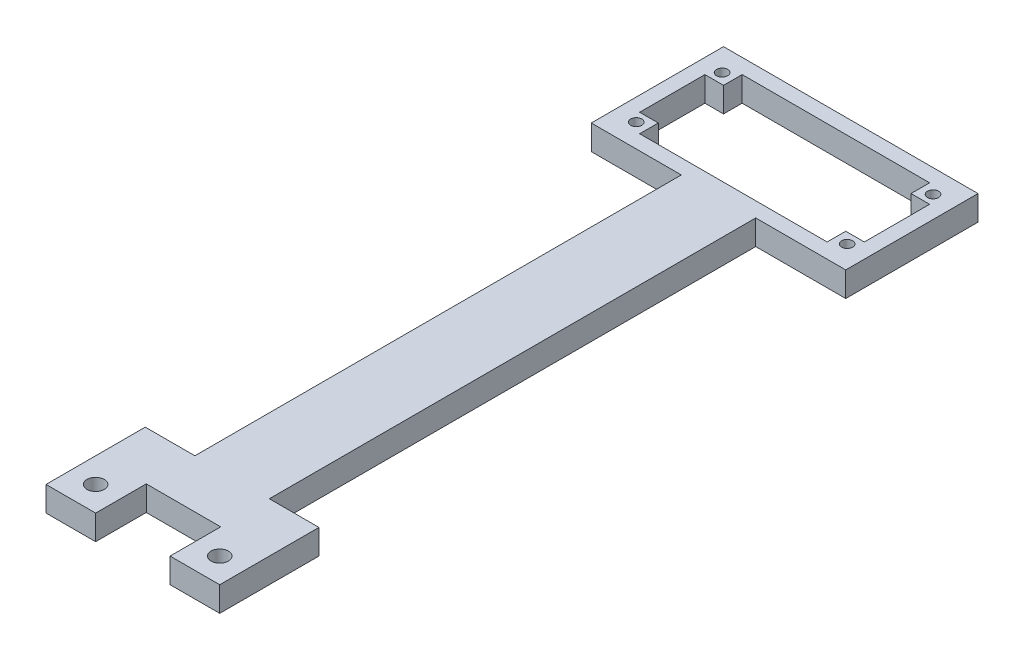
ISO-10303-21;
HEADER;
FILE_DESCRIPTION(('STEP AP214'),'2;1');
FILE_NAME('part.step','',(''),(''),'','','');
FILE_SCHEMA(('AUTOMOTIVE_DESIGN { 1 0 10303 214 1 1 1 1 }'));
ENDSEC;
DATA;
#1=APPLICATION_CONTEXT('core data for automotive mechanical design processes');
#2=APPLICATION_PROTOCOL_DEFINITION('international standard','automotive_design',2000,#1);
#3=PRODUCT_CONTEXT('',#1,'mechanical');
#4=PRODUCT('Part','Part','',(#3));
#5=PRODUCT_RELATED_PRODUCT_CATEGORY('part','',(#4));
#6=PRODUCT_DEFINITION_FORMATION('','',#4);
#7=PRODUCT_DEFINITION_CONTEXT('part definition',#1,'design');
#8=PRODUCT_DEFINITION('design','',#6,#7);
#9=PRODUCT_DEFINITION_SHAPE('','',#8);
#10=(LENGTH_UNIT() NAMED_UNIT(*) SI_UNIT(.MILLI.,.METRE.));
#11=(NAMED_UNIT(*) PLANE_ANGLE_UNIT() SI_UNIT($,.RADIAN.));
#12=(NAMED_UNIT(*) SI_UNIT($,.STERADIAN.) SOLID_ANGLE_UNIT());
#13=UNCERTAINTY_MEASURE_WITH_UNIT(LENGTH_MEASURE(1.E-05),#10,'distance_accuracy_value','');
#14=(GEOMETRIC_REPRESENTATION_CONTEXT(3) GLOBAL_UNCERTAINTY_ASSIGNED_CONTEXT((#13)) GLOBAL_UNIT_ASSIGNED_CONTEXT((#10,
#11,#12)) REPRESENTATION_CONTEXT('',''));
#15=CARTESIAN_POINT('',(0.,0.,0.));
#16=DIRECTION('',(0.,0.,1.));
#17=DIRECTION('',(1.,0.,0.));
#18=AXIS2_PLACEMENT_3D('',#15,#16,#17);
#19=CARTESIAN_POINT('',(-3.,5.,3.));
#20=DIRECTION('',(0.,0.,-1.));
#21=DIRECTION('',(-1.,0.,0.));
#22=AXIS2_PLACEMENT_3D('',#19,#20,#21);
#23=PLANE('',#22);
#24=DIRECTION('',(0.,1.,0.));
#25=VECTOR('',#24,1.);
#26=CARTESIAN_POINT('',(30.135,-109.036691072317,3.));
#27=LINE('',#26,#25);
#28=CARTESIAN_POINT('',(30.135,0.,3.));
#29=VERTEX_POINT('',#28);
#30=CARTESIAN_POINT('',(30.135,5.,3.));
#31=VERTEX_POINT('',#30);
#32=EDGE_CURVE('E364',#29,#31,#27,.T.);
#33=ORIENTED_EDGE('',*,*,#32,.F.);
#34=DIRECTION('',(1.,0.,0.));
#35=VECTOR('',#34,1.);
#36=CARTESIAN_POINT('',(-3.,0.,3.));
#37=LINE('',#36,#35);
#38=CARTESIAN_POINT('',(48.27,0.,3.));
#39=VERTEX_POINT('',#38);
#40=EDGE_CURVE('E516',#29,#39,#37,.T.);
#41=ORIENTED_EDGE('',*,*,#40,.T.);
#42=DIRECTION('',(0.,-1.,0.));
#43=VECTOR('',#42,1.);
#44=CARTESIAN_POINT('',(48.27,5.,3.));
#45=LINE('',#44,#43);
#46=CARTESIAN_POINT('',(48.27,5.,3.));
#47=VERTEX_POINT('',#46);
#48=EDGE_CURVE('E11',#47,#39,#45,.T.);
#49=ORIENTED_EDGE('',*,*,#48,.F.);
#50=DIRECTION('',(1.,0.,0.));
#51=VECTOR('',#50,1.);
#52=CARTESIAN_POINT('',(-3.,5.,3.));
#53=LINE('',#52,#51);
#54=EDGE_CURVE('E534',#31,#47,#53,.T.);
#55=ORIENTED_EDGE('',*,*,#54,.F.);
#56=EDGE_LOOP('',(#33,#41,#49,#55));
#57=FACE_BOUND('',#56,.T.);
#58=ADVANCED_FACE('F39',(#57),#23,.F.);
#59=CARTESIAN_POINT('',(-3.,0.,3.));
#60=VERTEX_POINT('',#59);
#61=CARTESIAN_POINT('',(15.135,0.,3.));
#62=VERTEX_POINT('',#61);
#63=EDGE_CURVE('E544',#60,#62,#37,.T.);
#64=ORIENTED_EDGE('',*,*,#63,.T.);
#65=DIRECTION('',(0.,1.,0.));
#66=VECTOR('',#65,1.);
#67=CARTESIAN_POINT('',(15.135,-109.036691072317,3.));
#68=LINE('',#67,#66);
#69=CARTESIAN_POINT('',(15.135,5.,3.));
#70=VERTEX_POINT('',#69);
#71=EDGE_CURVE('E63',#62,#70,#68,.T.);
#72=ORIENTED_EDGE('',*,*,#71,.T.);
#73=CARTESIAN_POINT('',(-3.,5.,3.));
#74=VERTEX_POINT('',#73);
#75=EDGE_CURVE('E530',#74,#70,#53,.T.);
#76=ORIENTED_EDGE('',*,*,#75,.F.);
#77=DIRECTION('',(0.,-1.,0.));
#78=VECTOR('',#77,1.);
#79=CARTESIAN_POINT('',(-3.,5.,3.));
#80=LINE('',#79,#78);
#81=EDGE_CURVE('E543',#74,#60,#80,.T.);
#82=ORIENTED_EDGE('',*,*,#81,.T.);
#83=EDGE_LOOP('',(#64,#72,#76,#82));
#84=FACE_BOUND('',#83,.T.);
#85=ADVANCED_FACE('F41',(#84),#23,.F.);
#86=CARTESIAN_POINT('',(48.27,5.,3.));
#87=DIRECTION('',(-1.,0.,0.));
#88=DIRECTION('',(0.,0.,1.));
#89=AXIS2_PLACEMENT_3D('',#86,#87,#88);
#90=PLANE('',#89);
#91=DIRECTION('',(0.,0.,-1.));
#92=VECTOR('',#91,1.);
#93=CARTESIAN_POINT('',(48.27,0.,3.));
#94=LINE('',#93,#92);
#95=CARTESIAN_POINT('',(48.27,0.,-23.65));
#96=VERTEX_POINT('',#95);
#97=EDGE_CURVE('E547',#39,#96,#94,.T.);
#98=ORIENTED_EDGE('',*,*,#97,.T.);
#99=DIRECTION('',(0.,-1.,0.));
#100=VECTOR('',#99,1.);
#101=CARTESIAN_POINT('',(48.27,5.,-23.65));
#102=LINE('',#101,#100);
#103=CARTESIAN_POINT('',(48.27,5.,-23.65));
#104=VERTEX_POINT('',#103);
#105=EDGE_CURVE('E48',#104,#96,#102,.T.);
#106=ORIENTED_EDGE('',*,*,#105,.F.);
#107=DIRECTION('',(0.,0.,-1.));
#108=VECTOR('',#107,1.);
#109=CARTESIAN_POINT('',(48.27,5.,3.));
#110=LINE('',#109,#108);
#111=EDGE_CURVE('E533',#47,#104,#110,.T.);
#112=ORIENTED_EDGE('',*,*,#111,.F.);
#113=ORIENTED_EDGE('',*,*,#48,.T.);
#114=EDGE_LOOP('',(#98,#106,#112,#113));
#115=FACE_BOUND('',#114,.T.);
#116=ADVANCED_FACE('F624',(#115),#90,.F.);
#117=CARTESIAN_POINT('',(48.27,5.,-23.65));
#118=DIRECTION('',(0.,0.,1.));
#119=DIRECTION('',(1.,0.,0.));
#120=AXIS2_PLACEMENT_3D('',#117,#118,#119);
#121=PLANE('',#120);
#122=DIRECTION('',(-1.,0.,0.));
#123=VECTOR('',#122,1.);
#124=CARTESIAN_POINT('',(48.27,0.,-23.65));
#125=LINE('',#124,#123);
#126=CARTESIAN_POINT('',(-3.,0.,-23.65));
#127=VERTEX_POINT('',#126);
#128=EDGE_CURVE('E550',#96,#127,#125,.T.);
#129=ORIENTED_EDGE('',*,*,#128,.T.);
#130=DIRECTION('',(0.,-1.,0.));
#131=VECTOR('',#130,1.);
#132=CARTESIAN_POINT('',(-3.,5.,-23.65));
#133=LINE('',#132,#131);
#134=CARTESIAN_POINT('',(-3.,5.,-23.65));
#135=VERTEX_POINT('',#134);
#136=EDGE_CURVE('E559',#135,#127,#133,.T.);
#137=ORIENTED_EDGE('',*,*,#136,.F.);
#138=DIRECTION('',(-1.,0.,0.));
#139=VECTOR('',#138,1.);
#140=CARTESIAN_POINT('',(48.27,5.,-23.65));
#141=LINE('',#140,#139);
#142=EDGE_CURVE('E537',#104,#135,#141,.T.);
#143=ORIENTED_EDGE('',*,*,#142,.F.);
#144=ORIENTED_EDGE('',*,*,#105,.T.);
#145=EDGE_LOOP('',(#129,#137,#143,#144));
#146=FACE_BOUND('',#145,.T.);
#147=ADVANCED_FACE('F568',(#146),#121,.F.);
#148=CARTESIAN_POINT('',(-3.,5.,-23.65));
#149=DIRECTION('',(1.,0.,0.));
#150=DIRECTION('',(0.,0.,-1.));
#151=AXIS2_PLACEMENT_3D('',#148,#149,#150);
#152=PLANE('',#151);
#153=DIRECTION('',(0.,0.,1.));
#154=VECTOR('',#153,1.);
#155=CARTESIAN_POINT('',(-3.,0.,-23.65));
#156=LINE('',#155,#154);
#157=EDGE_CURVE('E553',#127,#60,#156,.T.);
#158=ORIENTED_EDGE('',*,*,#157,.T.);
#159=ORIENTED_EDGE('',*,*,#81,.F.);
#160=DIRECTION('',(0.,0.,1.));
#161=VECTOR('',#160,1.);
#162=CARTESIAN_POINT('',(-3.,5.,-23.65));
#163=LINE('',#162,#161);
#164=EDGE_CURVE('E540',#135,#74,#163,.T.);
#165=ORIENTED_EDGE('',*,*,#164,.F.);
#166=ORIENTED_EDGE('',*,*,#136,.T.);
#167=EDGE_LOOP('',(#158,#159,#165,#166));
#168=FACE_BOUND('',#167,.T.);
#169=ADVANCED_FACE('F578',(#168),#152,.F.);
#170=CARTESIAN_POINT('',(0.,5.,0.));
#171=DIRECTION('',(0.,1.,0.));
#172=DIRECTION('',(0.,0.,1.));
#173=AXIS2_PLACEMENT_3D('',#170,#171,#172);
#174=PLANE('',#173);
#175=DIRECTION('',(0.,0.,-1.));
#176=VECTOR('',#175,1.);
#177=CARTESIAN_POINT('',(15.135,5.,101.));
#178=LINE('',#177,#176);
#179=CARTESIAN_POINT('',(15.135,5.,121.));
#180=VERTEX_POINT('',#179);
#181=CARTESIAN_POINT('',(15.135,5.,110.8));
#182=VERTEX_POINT('',#181);
#183=EDGE_CURVE('E267',#180,#182,#178,.T.);
#184=ORIENTED_EDGE('',*,*,#183,.T.);
#185=DIRECTION('',(-1.,0.,0.));
#186=VECTOR('',#185,1.);
#187=CARTESIAN_POINT('',(15.135,5.,110.8));
#188=LINE('',#187,#186);
#189=CARTESIAN_POINT('',(30.135,5.,110.8));
#190=VERTEX_POINT('',#189);
#191=EDGE_CURVE('E255',#190,#182,#188,.T.);
#192=ORIENTED_EDGE('',*,*,#191,.F.);
#193=DIRECTION('',(0.,0.,1.));
#194=VECTOR('',#193,1.);
#195=CARTESIAN_POINT('',(30.135,5.,101.));
#196=LINE('',#195,#194);
#197=CARTESIAN_POINT('',(30.135,5.,121.));
#198=VERTEX_POINT('',#197);
#199=EDGE_CURVE('E244',#190,#198,#196,.T.);
#200=ORIENTED_EDGE('',*,*,#199,.T.);
#201=DIRECTION('',(1.,0.,0.));
#202=VECTOR('',#201,1.);
#203=CARTESIAN_POINT('',(30.135,5.,121.));
#204=LINE('',#203,#202);
#205=CARTESIAN_POINT('',(40.135,5.,121.));
#206=VERTEX_POINT('',#205);
#207=EDGE_CURVE('E324',#198,#206,#204,.T.);
#208=ORIENTED_EDGE('',*,*,#207,.T.);
#209=DIRECTION('',(0.,0.,-1.));
#210=VECTOR('',#209,1.);
#211=CARTESIAN_POINT('',(40.135,5.,101.));
#212=LINE('',#211,#210);
#213=CARTESIAN_POINT('',(40.135,5.,101.));
#214=VERTEX_POINT('',#213);
#215=EDGE_CURVE('E328',#206,#214,#212,.T.);
#216=ORIENTED_EDGE('',*,*,#215,.T.);
#217=DIRECTION('',(-1.,0.,0.));
#218=VECTOR('',#217,1.);
#219=CARTESIAN_POINT('',(30.135,5.,101.));
#220=LINE('',#219,#218);
#221=CARTESIAN_POINT('',(30.135,5.,101.));
#222=VERTEX_POINT('',#221);
#223=EDGE_CURVE('E332',#214,#222,#220,.T.);
#224=ORIENTED_EDGE('',*,*,#223,.T.);
#225=DIRECTION('',(0.,0.,-1.));
#226=VECTOR('',#225,1.);
#227=CARTESIAN_POINT('',(30.135,5.,3.));
#228=LINE('',#227,#226);
#229=EDGE_CURVE('E349',#222,#31,#228,.T.);
#230=ORIENTED_EDGE('',*,*,#229,.T.);
#231=ORIENTED_EDGE('',*,*,#54,.T.);
#232=ORIENTED_EDGE('',*,*,#111,.T.);
#233=ORIENTED_EDGE('',*,*,#142,.T.);
#234=ORIENTED_EDGE('',*,*,#164,.T.);
#235=ORIENTED_EDGE('',*,*,#75,.T.);
#236=DIRECTION('',(0.,0.,1.));
#237=VECTOR('',#236,1.);
#238=CARTESIAN_POINT('',(15.135,5.,3.));
#239=LINE('',#238,#237);
#240=CARTESIAN_POINT('',(15.135,5.,101.));
#241=VERTEX_POINT('',#240);
#242=EDGE_CURVE('E360',#70,#241,#239,.T.);
#243=ORIENTED_EDGE('',*,*,#242,.T.);
#244=DIRECTION('',(-1.,0.,0.));
#245=VECTOR('',#244,1.);
#246=CARTESIAN_POINT('',(15.135,5.,101.));
#247=LINE('',#246,#245);
#248=CARTESIAN_POINT('',(5.135,5.,101.));
#249=VERTEX_POINT('',#248);
#250=EDGE_CURVE('E292',#241,#249,#247,.T.);
#251=ORIENTED_EDGE('',*,*,#250,.T.);
#252=DIRECTION('',(0.,0.,1.));
#253=VECTOR('',#252,1.);
#254=CARTESIAN_POINT('',(5.135,5.,101.));
#255=LINE('',#254,#253);
#256=CARTESIAN_POINT('',(5.135,5.,121.));
#257=VERTEX_POINT('',#256);
#258=EDGE_CURVE('E296',#249,#257,#255,.T.);
#259=ORIENTED_EDGE('',*,*,#258,.T.);
#260=DIRECTION('',(1.,0.,0.));
#261=VECTOR('',#260,1.);
#262=CARTESIAN_POINT('',(15.135,5.,121.));
#263=LINE('',#262,#261);
#264=EDGE_CURVE('E300',#257,#180,#263,.T.);
#265=ORIENTED_EDGE('',*,*,#264,.T.);
#266=EDGE_LOOP('',(#184,#192,#200,#208,#216,#224,#230,#231,#232,#233,#234,#235,#243,#251,#259,#265));
#267=FACE_BOUND('',#266,.T.);
#268=CARTESIAN_POINT('',(10.135,5.,116.));
#269=DIRECTION('',(0.,1.,0.));
#270=DIRECTION('',(0.,0.,1.));
#271=AXIS2_PLACEMENT_3D('',#268,#269,#270);
#272=CIRCLE('',#271,1.75);
#273=CARTESIAN_POINT('',(10.135,5.,117.75));
#274=VERTEX_POINT('',#273);
#275=EDGE_CURVE('E268',#274,#274,#272,.T.);
#276=ORIENTED_EDGE('',*,*,#275,.F.);
#277=EDGE_LOOP('',(#276));
#278=FACE_BOUND('',#277,.T.);
#279=CARTESIAN_POINT('',(35.135,5.,116.));
#280=DIRECTION('',(0.,1.,0.));
#281=DIRECTION('',(0.,0.,1.));
#282=AXIS2_PLACEMENT_3D('',#279,#280,#281);
#283=CIRCLE('',#282,1.75);
#284=CARTESIAN_POINT('',(35.135,5.,117.75));
#285=VERTEX_POINT('',#284);
#286=EDGE_CURVE('E261',#285,#285,#283,.T.);
#287=ORIENTED_EDGE('',*,*,#286,.F.);
#288=EDGE_LOOP('',(#287));
#289=FACE_BOUND('',#288,.T.);
#290=CARTESIAN_POINT('',(1.385,5.,-1.675));
#291=DIRECTION('',(0.,1.,0.));
#292=DIRECTION('',(0.,0.,1.));
#293=AXIS2_PLACEMENT_3D('',#290,#291,#292);
#294=CIRCLE('',#293,1.12);
#295=CARTESIAN_POINT('',(1.385,5.,-0.555000000000001));
#296=VERTEX_POINT('',#295);
#297=EDGE_CURVE('E357',#296,#296,#294,.T.);
#298=ORIENTED_EDGE('',*,*,#297,.F.);
#299=EDGE_LOOP('',(#298));
#300=FACE_BOUND('',#299,.T.);
#301=CARTESIAN_POINT('',(43.885,5.,-1.675));
#302=DIRECTION('',(0.,1.,0.));
#303=DIRECTION('',(0.,0.,1.));
#304=AXIS2_PLACEMENT_3D('',#301,#302,#303);
#305=CIRCLE('',#304,1.12000000000001);
#306=CARTESIAN_POINT('',(43.885,5.,-0.554999999999996));
#307=VERTEX_POINT('',#306);
#308=EDGE_CURVE('E383',#307,#307,#305,.T.);
#309=ORIENTED_EDGE('',*,*,#308,.F.);
#310=EDGE_LOOP('',(#309));
#311=FACE_BOUND('',#310,.T.);
#312=CARTESIAN_POINT('',(43.885,5.,-18.975));
#313=DIRECTION('',(0.,1.,0.));
#314=DIRECTION('',(0.,0.,1.));
#315=AXIS2_PLACEMENT_3D('',#312,#313,#314);
#316=CIRCLE('',#315,1.12);
#317=CARTESIAN_POINT('',(43.885,5.,-17.855));
#318=VERTEX_POINT('',#317);
#319=EDGE_CURVE('E375',#318,#318,#316,.T.);
#320=ORIENTED_EDGE('',*,*,#319,.F.);
#321=EDGE_LOOP('',(#320));
#322=FACE_BOUND('',#321,.T.);
#323=CARTESIAN_POINT('',(1.385,5.,-18.975));
#324=DIRECTION('',(0.,1.,0.));
#325=DIRECTION('',(0.,0.,1.));
#326=AXIS2_PLACEMENT_3D('',#323,#324,#325);
#327=CIRCLE('',#326,1.12);
#328=CARTESIAN_POINT('',(1.385,5.,-17.855));
#329=VERTEX_POINT('',#328);
#330=EDGE_CURVE('E374',#329,#329,#327,.T.);
#331=ORIENTED_EDGE('',*,*,#330,.F.);
#332=EDGE_LOOP('',(#331));
#333=FACE_BOUND('',#332,.T.);
#334=DIRECTION('',(-1.,0.,0.));
#335=VECTOR('',#334,1.);
#336=CARTESIAN_POINT('',(0.,5.,-20.65));
#337=LINE('',#336,#335);
#338=CARTESIAN_POINT('',(41.52,5.,-20.65));
#339=VERTEX_POINT('',#338);
#340=CARTESIAN_POINT('',(3.75,5.,-20.65));
#341=VERTEX_POINT('',#340);
#342=EDGE_CURVE('E505',#339,#341,#337,.T.);
#343=ORIENTED_EDGE('',*,*,#342,.F.);
#344=DIRECTION('',(0.,0.,1.));
#345=VECTOR('',#344,1.);
#346=CARTESIAN_POINT('',(41.52,5.,-20.65));
#347=LINE('',#346,#345);
#348=CARTESIAN_POINT('',(41.52,5.,-16.9));
#349=VERTEX_POINT('',#348);
#350=EDGE_CURVE('E398',#339,#349,#347,.T.);
#351=ORIENTED_EDGE('',*,*,#350,.T.);
#352=DIRECTION('',(1.,0.,0.));
#353=VECTOR('',#352,1.);
#354=CARTESIAN_POINT('',(45.27,5.,-16.9));
#355=LINE('',#354,#353);
#356=CARTESIAN_POINT('',(45.27,5.,-16.9));
#357=VERTEX_POINT('',#356);
#358=EDGE_CURVE('E413',#349,#357,#355,.T.);
#359=ORIENTED_EDGE('',*,*,#358,.T.);
#360=DIRECTION('',(0.,0.,-1.));
#361=VECTOR('',#360,1.);
#362=CARTESIAN_POINT('',(45.27,5.,0.));
#363=LINE('',#362,#361);
#364=CARTESIAN_POINT('',(45.27,5.,-3.75));
#365=VERTEX_POINT('',#364);
#366=EDGE_CURVE('E524',#365,#357,#363,.T.);
#367=ORIENTED_EDGE('',*,*,#366,.F.);
#368=DIRECTION('',(-1.,0.,0.));
#369=VECTOR('',#368,1.);
#370=CARTESIAN_POINT('',(45.27,5.,-3.75));
#371=LINE('',#370,#369);
#372=CARTESIAN_POINT('',(41.52,5.,-3.75));
#373=VERTEX_POINT('',#372);
#374=EDGE_CURVE('E409',#365,#373,#371,.T.);
#375=ORIENTED_EDGE('',*,*,#374,.T.);
#376=DIRECTION('',(0.,0.,1.));
#377=VECTOR('',#376,1.);
#378=CARTESIAN_POINT('',(41.52,5.,0.));
#379=LINE('',#378,#377);
#380=CARTESIAN_POINT('',(41.52,5.,0.));
#381=VERTEX_POINT('',#380);
#382=EDGE_CURVE('E434',#373,#381,#379,.T.);
#383=ORIENTED_EDGE('',*,*,#382,.T.);
#384=DIRECTION('',(1.,0.,0.));
#385=VECTOR('',#384,1.);
#386=CARTESIAN_POINT('',(0.,5.,0.));
#387=LINE('',#386,#385);
#388=CARTESIAN_POINT('',(3.75,5.,0.));
#389=VERTEX_POINT('',#388);
#390=EDGE_CURVE('E520',#389,#381,#387,.T.);
#391=ORIENTED_EDGE('',*,*,#390,.F.);
#392=DIRECTION('',(0.,0.,-1.));
#393=VECTOR('',#392,1.);
#394=CARTESIAN_POINT('',(3.75,5.,0.));
#395=LINE('',#394,#393);
#396=CARTESIAN_POINT('',(3.75,5.,-3.74999999999999));
#397=VERTEX_POINT('',#396);
#398=EDGE_CURVE('E449',#389,#397,#395,.T.);
#399=ORIENTED_EDGE('',*,*,#398,.T.);
#400=DIRECTION('',(-1.,0.,0.));
#401=VECTOR('',#400,1.);
#402=CARTESIAN_POINT('',(0.,5.,-3.74999999999999));
#403=LINE('',#402,#401);
#404=CARTESIAN_POINT('',(0.,5.,-3.74999999999999));
#405=VERTEX_POINT('',#404);
#406=EDGE_CURVE('E462',#397,#405,#403,.T.);
#407=ORIENTED_EDGE('',*,*,#406,.T.);
#408=DIRECTION('',(0.,0.,1.));
#409=VECTOR('',#408,1.);
#410=CARTESIAN_POINT('',(0.,5.,0.));
#411=LINE('',#410,#409);
#412=CARTESIAN_POINT('',(0.,5.,-16.9));
#413=VERTEX_POINT('',#412);
#414=EDGE_CURVE('E499',#413,#405,#411,.T.);
#415=ORIENTED_EDGE('',*,*,#414,.F.);
#416=DIRECTION('',(1.,0.,0.));
#417=VECTOR('',#416,1.);
#418=CARTESIAN_POINT('',(0.,5.,-16.9));
#419=LINE('',#418,#417);
#420=CARTESIAN_POINT('',(3.75,5.,-16.9));
#421=VERTEX_POINT('',#420);
#422=EDGE_CURVE('E458',#413,#421,#419,.T.);
#423=ORIENTED_EDGE('',*,*,#422,.T.);
#424=DIRECTION('',(0.,0.,-1.));
#425=VECTOR('',#424,1.);
#426=CARTESIAN_POINT('',(3.75,5.,-20.65));
#427=LINE('',#426,#425);
#428=EDGE_CURVE('E483',#421,#341,#427,.T.);
#429=ORIENTED_EDGE('',*,*,#428,.T.);
#430=EDGE_LOOP('',(#343,#351,#359,#367,#375,#383,#391,#399,#407,#415,#423,#429));
#431=FACE_BOUND('',#430,.T.);
#432=ADVANCED_FACE('F582',(#267,#278,#289,#300,#311,#322,#333,#431),#174,.T.);
#433=CARTESIAN_POINT('',(0.,0.,0.));
#434=DIRECTION('',(0.,1.,0.));
#435=DIRECTION('',(0.,0.,1.));
#436=AXIS2_PLACEMENT_3D('',#433,#434,#435);
#437=PLANE('',#436);
#438=CARTESIAN_POINT('',(10.135,0.,116.));
#439=DIRECTION('',(0.,1.,0.));
#440=DIRECTION('',(0.,0.,1.));
#441=AXIS2_PLACEMENT_3D('',#438,#439,#440);
#442=CIRCLE('',#441,1.75);
#443=CARTESIAN_POINT('',(10.135,0.,117.75));
#444=VERTEX_POINT('',#443);
#445=EDGE_CURVE('E263',#444,#444,#442,.T.);
#446=ORIENTED_EDGE('',*,*,#445,.T.);
#447=EDGE_LOOP('',(#446));
#448=FACE_BOUND('',#447,.T.);
#449=CARTESIAN_POINT('',(35.135,0.,116.));
#450=DIRECTION('',(0.,1.,0.));
#451=DIRECTION('',(0.,0.,1.));
#452=AXIS2_PLACEMENT_3D('',#449,#450,#451);
#453=CIRCLE('',#452,1.75);
#454=CARTESIAN_POINT('',(35.135,0.,117.75));
#455=VERTEX_POINT('',#454);
#456=EDGE_CURVE('E272',#455,#455,#453,.T.);
#457=ORIENTED_EDGE('',*,*,#456,.T.);
#458=EDGE_LOOP('',(#457));
#459=FACE_BOUND('',#458,.T.);
#460=CARTESIAN_POINT('',(1.385,0.,-1.675));
#461=DIRECTION('',(0.,1.,0.));
#462=DIRECTION('',(0.,0.,1.));
#463=AXIS2_PLACEMENT_3D('',#460,#461,#462);
#464=CIRCLE('',#463,1.12);
#465=CARTESIAN_POINT('',(1.385,0.,-0.555000000000001));
#466=VERTEX_POINT('',#465);
#467=EDGE_CURVE('E387',#466,#466,#464,.T.);
#468=ORIENTED_EDGE('',*,*,#467,.T.);
#469=EDGE_LOOP('',(#468));
#470=FACE_BOUND('',#469,.T.);
#471=CARTESIAN_POINT('',(43.885,0.,-1.675));
#472=DIRECTION('',(0.,1.,0.));
#473=DIRECTION('',(0.,0.,1.));
#474=AXIS2_PLACEMENT_3D('',#471,#472,#473);
#475=CIRCLE('',#474,1.12000000000001);
#476=CARTESIAN_POINT('',(43.885,0.,-0.554999999999996));
#477=VERTEX_POINT('',#476);
#478=EDGE_CURVE('E379',#477,#477,#475,.T.);
#479=ORIENTED_EDGE('',*,*,#478,.T.);
#480=EDGE_LOOP('',(#479));
#481=FACE_BOUND('',#480,.T.);
#482=CARTESIAN_POINT('',(43.885,0.,-18.975));
#483=DIRECTION('',(0.,1.,0.));
#484=DIRECTION('',(0.,0.,1.));
#485=AXIS2_PLACEMENT_3D('',#482,#483,#484);
#486=CIRCLE('',#485,1.12);
#487=CARTESIAN_POINT('',(43.885,0.,-17.855));
#488=VERTEX_POINT('',#487);
#489=EDGE_CURVE('E370',#488,#488,#486,.T.);
#490=ORIENTED_EDGE('',*,*,#489,.T.);
#491=EDGE_LOOP('',(#490));
#492=FACE_BOUND('',#491,.T.);
#493=CARTESIAN_POINT('',(1.385,0.,-18.975));
#494=DIRECTION('',(0.,1.,0.));
#495=DIRECTION('',(0.,0.,1.));
#496=AXIS2_PLACEMENT_3D('',#493,#494,#495);
#497=CIRCLE('',#496,1.12);
#498=CARTESIAN_POINT('',(1.385,0.,-17.855));
#499=VERTEX_POINT('',#498);
#500=EDGE_CURVE('E394',#499,#499,#497,.T.);
#501=ORIENTED_EDGE('',*,*,#500,.T.);
#502=EDGE_LOOP('',(#501));
#503=FACE_BOUND('',#502,.T.);
#504=DIRECTION('',(0.,0.,-1.));
#505=VECTOR('',#504,1.);
#506=CARTESIAN_POINT('',(41.52,0.,-20.65));
#507=LINE('',#506,#505);
#508=CARTESIAN_POINT('',(41.52,0.,-16.9));
#509=VERTEX_POINT('',#508);
#510=CARTESIAN_POINT('',(41.52,0.,-20.65));
#511=VERTEX_POINT('',#510);
#512=EDGE_CURVE('E402',#509,#511,#507,.T.);
#513=ORIENTED_EDGE('',*,*,#512,.T.);
#514=DIRECTION('',(-1.,0.,0.));
#515=VECTOR('',#514,1.);
#516=CARTESIAN_POINT('',(0.,0.,-20.65));
#517=LINE('',#516,#515);
#518=CARTESIAN_POINT('',(3.75,0.,-20.65));
#519=VERTEX_POINT('',#518);
#520=EDGE_CURVE('E513',#511,#519,#517,.T.);
#521=ORIENTED_EDGE('',*,*,#520,.T.);
#522=DIRECTION('',(0.,0.,1.));
#523=VECTOR('',#522,1.);
#524=CARTESIAN_POINT('',(3.75,0.,-20.65));
#525=LINE('',#524,#523);
#526=CARTESIAN_POINT('',(3.75,0.,-16.9));
#527=VERTEX_POINT('',#526);
#528=EDGE_CURVE('E475',#519,#527,#525,.T.);
#529=ORIENTED_EDGE('',*,*,#528,.T.);
#530=DIRECTION('',(-1.,0.,0.));
#531=VECTOR('',#530,1.);
#532=CARTESIAN_POINT('',(0.,0.,-16.9));
#533=LINE('',#532,#531);
#534=CARTESIAN_POINT('',(0.,0.,-16.9));
#535=VERTEX_POINT('',#534);
#536=EDGE_CURVE('E478',#527,#535,#533,.T.);
#537=ORIENTED_EDGE('',*,*,#536,.T.);
#538=DIRECTION('',(0.,0.,1.));
#539=VECTOR('',#538,1.);
#540=CARTESIAN_POINT('',(0.,0.,0.));
#541=LINE('',#540,#539);
#542=CARTESIAN_POINT('',(0.,0.,-3.74999999999999));
#543=VERTEX_POINT('',#542);
#544=EDGE_CURVE('E500',#535,#543,#541,.T.);
#545=ORIENTED_EDGE('',*,*,#544,.T.);
#546=DIRECTION('',(1.,0.,0.));
#547=VECTOR('',#546,1.);
#548=CARTESIAN_POINT('',(0.,0.,-3.74999999999999));
#549=LINE('',#548,#547);
#550=CARTESIAN_POINT('',(3.75,0.,-3.74999999999999));
#551=VERTEX_POINT('',#550);
#552=EDGE_CURVE('E454',#543,#551,#549,.T.);
#553=ORIENTED_EDGE('',*,*,#552,.T.);
#554=DIRECTION('',(0.,0.,1.));
#555=VECTOR('',#554,1.);
#556=CARTESIAN_POINT('',(3.75,0.,0.));
#557=LINE('',#556,#555);
#558=CARTESIAN_POINT('',(3.75,0.,0.));
#559=VERTEX_POINT('',#558);
#560=EDGE_CURVE('E450',#551,#559,#557,.T.);
#561=ORIENTED_EDGE('',*,*,#560,.T.);
#562=DIRECTION('',(1.,0.,0.));
#563=VECTOR('',#562,1.);
#564=CARTESIAN_POINT('',(0.,0.,0.));
#565=LINE('',#564,#563);
#566=CARTESIAN_POINT('',(41.52,0.,0.));
#567=VERTEX_POINT('',#566);
#568=EDGE_CURVE('E504',#559,#567,#565,.T.);
#569=ORIENTED_EDGE('',*,*,#568,.T.);
#570=DIRECTION('',(0.,0.,-1.));
#571=VECTOR('',#570,1.);
#572=CARTESIAN_POINT('',(41.52,0.,0.));
#573=LINE('',#572,#571);
#574=CARTESIAN_POINT('',(41.52,0.,-3.75));
#575=VERTEX_POINT('',#574);
#576=EDGE_CURVE('E426',#567,#575,#573,.T.);
#577=ORIENTED_EDGE('',*,*,#576,.T.);
#578=DIRECTION('',(1.,0.,0.));
#579=VECTOR('',#578,1.);
#580=CARTESIAN_POINT('',(45.27,0.,-3.75));
#581=LINE('',#580,#579);
#582=CARTESIAN_POINT('',(45.27,0.,-3.75));
#583=VERTEX_POINT('',#582);
#584=EDGE_CURVE('E429',#575,#583,#581,.T.);
#585=ORIENTED_EDGE('',*,*,#584,.T.);
#586=DIRECTION('',(0.,0.,-1.));
#587=VECTOR('',#586,1.);
#588=CARTESIAN_POINT('',(45.27,0.,0.));
#589=LINE('',#588,#587);
#590=CARTESIAN_POINT('',(45.27,0.,-16.9));
#591=VERTEX_POINT('',#590);
#592=EDGE_CURVE('E509',#583,#591,#589,.T.);
#593=ORIENTED_EDGE('',*,*,#592,.T.);
#594=DIRECTION('',(-1.,0.,0.));
#595=VECTOR('',#594,1.);
#596=CARTESIAN_POINT('',(45.27,0.,-16.9));
#597=LINE('',#596,#595);
#598=EDGE_CURVE('E405',#591,#509,#597,.T.);
#599=ORIENTED_EDGE('',*,*,#598,.T.);
#600=EDGE_LOOP('',(#513,#521,#529,#537,#545,#553,#561,#569,#577,#585,#593,#599));
#601=FACE_BOUND('',#600,.T.);
#602=DIRECTION('',(-1.,0.,0.));
#603=VECTOR('',#602,1.);
#604=CARTESIAN_POINT('',(15.135,0.,110.8));
#605=LINE('',#604,#603);
#606=CARTESIAN_POINT('',(30.135,0.,110.8));
#607=VERTEX_POINT('',#606);
#608=CARTESIAN_POINT('',(15.135,0.,110.8));
#609=VERTEX_POINT('',#608);
#610=EDGE_CURVE('E232',#607,#609,#605,.T.);
#611=ORIENTED_EDGE('',*,*,#610,.T.);
#612=DIRECTION('',(0.,0.,1.));
#613=VECTOR('',#612,1.);
#614=CARTESIAN_POINT('',(15.135,0.,101.));
#615=LINE('',#614,#613);
#616=CARTESIAN_POINT('',(15.135,0.,121.));
#617=VERTEX_POINT('',#616);
#618=EDGE_CURVE('E286',#609,#617,#615,.T.);
#619=ORIENTED_EDGE('',*,*,#618,.T.);
#620=DIRECTION('',(-1.,0.,0.));
#621=VECTOR('',#620,1.);
#622=CARTESIAN_POINT('',(15.135,0.,121.));
#623=LINE('',#622,#621);
#624=CARTESIAN_POINT('',(5.135,0.,121.));
#625=VERTEX_POINT('',#624);
#626=EDGE_CURVE('E282',#617,#625,#623,.T.);
#627=ORIENTED_EDGE('',*,*,#626,.T.);
#628=DIRECTION('',(0.,0.,-1.));
#629=VECTOR('',#628,1.);
#630=CARTESIAN_POINT('',(5.135,0.,101.));
#631=LINE('',#630,#629);
#632=CARTESIAN_POINT('',(5.135,0.,101.));
#633=VERTEX_POINT('',#632);
#634=EDGE_CURVE('E279',#625,#633,#631,.T.);
#635=ORIENTED_EDGE('',*,*,#634,.T.);
#636=DIRECTION('',(1.,0.,0.));
#637=VECTOR('',#636,1.);
#638=CARTESIAN_POINT('',(15.135,0.,101.));
#639=LINE('',#638,#637);
#640=CARTESIAN_POINT('',(15.135,0.,101.));
#641=VERTEX_POINT('',#640);
#642=EDGE_CURVE('E289',#633,#641,#639,.T.);
#643=ORIENTED_EDGE('',*,*,#642,.T.);
#644=DIRECTION('',(0.,0.,-1.));
#645=VECTOR('',#644,1.);
#646=CARTESIAN_POINT('',(15.135,0.,3.));
#647=LINE('',#646,#645);
#648=EDGE_CURVE('E350',#641,#62,#647,.T.);
#649=ORIENTED_EDGE('',*,*,#648,.T.);
#650=ORIENTED_EDGE('',*,*,#63,.F.);
#651=ORIENTED_EDGE('',*,*,#157,.F.);
#652=ORIENTED_EDGE('',*,*,#128,.F.);
#653=ORIENTED_EDGE('',*,*,#97,.F.);
#654=ORIENTED_EDGE('',*,*,#40,.F.);
#655=DIRECTION('',(0.,0.,1.));
#656=VECTOR('',#655,1.);
#657=CARTESIAN_POINT('',(30.135,0.,3.));
#658=LINE('',#657,#656);
#659=CARTESIAN_POINT('',(30.135,0.,101.));
#660=VERTEX_POINT('',#659);
#661=EDGE_CURVE('E353',#29,#660,#658,.T.);
#662=ORIENTED_EDGE('',*,*,#661,.T.);
#663=DIRECTION('',(1.,0.,0.));
#664=VECTOR('',#663,1.);
#665=CARTESIAN_POINT('',(30.135,0.,101.));
#666=LINE('',#665,#664);
#667=CARTESIAN_POINT('',(40.135,0.,101.));
#668=VERTEX_POINT('',#667);
#669=EDGE_CURVE('E239',#660,#668,#666,.T.);
#670=ORIENTED_EDGE('',*,*,#669,.T.);
#671=DIRECTION('',(0.,0.,1.));
#672=VECTOR('',#671,1.);
#673=CARTESIAN_POINT('',(40.135,0.,101.));
#674=LINE('',#673,#672);
#675=CARTESIAN_POINT('',(40.135,0.,121.));
#676=VERTEX_POINT('',#675);
#677=EDGE_CURVE('E316',#668,#676,#674,.T.);
#678=ORIENTED_EDGE('',*,*,#677,.T.);
#679=DIRECTION('',(-1.,0.,0.));
#680=VECTOR('',#679,1.);
#681=CARTESIAN_POINT('',(30.135,0.,121.));
#682=LINE('',#681,#680);
#683=CARTESIAN_POINT('',(30.135,0.,121.));
#684=VERTEX_POINT('',#683);
#685=EDGE_CURVE('E234',#676,#684,#682,.T.);
#686=ORIENTED_EDGE('',*,*,#685,.T.);
#687=DIRECTION('',(0.,0.,-1.));
#688=VECTOR('',#687,1.);
#689=CARTESIAN_POINT('',(30.135,0.,101.));
#690=LINE('',#689,#688);
#691=EDGE_CURVE('E228',#684,#607,#690,.T.);
#692=ORIENTED_EDGE('',*,*,#691,.T.);
#693=EDGE_LOOP('',(#611,#619,#627,#635,#643,#649,#650,#651,#652,#653,#654,#662,#670,#678,#686,#692));
#694=FACE_BOUND('',#693,.T.);
#695=ADVANCED_FACE('F230',(#448,#459,#470,#481,#492,#503,#601,#694),#437,.F.);
#696=CARTESIAN_POINT('',(0.,0.,0.));
#697=DIRECTION('',(-1.,0.,0.));
#698=DIRECTION('',(0.,0.,1.));
#699=AXIS2_PLACEMENT_3D('',#696,#697,#698);
#700=PLANE('',#699);
#701=ORIENTED_EDGE('',*,*,#414,.T.);
#702=DIRECTION('',(0.,1.,0.));
#703=VECTOR('',#702,1.);
#704=CARTESIAN_POINT('',(0.,-5.30330085889911,-3.74999999999999));
#705=LINE('',#704,#703);
#706=EDGE_CURVE('E455',#543,#405,#705,.T.);
#707=ORIENTED_EDGE('',*,*,#706,.F.);
#708=ORIENTED_EDGE('',*,*,#544,.F.);
#709=DIRECTION('',(0.,1.,0.));
#710=VECTOR('',#709,1.);
#711=CARTESIAN_POINT('',(0.,-5.30330085889911,-16.9));
#712=LINE('',#711,#710);
#713=EDGE_CURVE('E487',#535,#413,#712,.T.);
#714=ORIENTED_EDGE('',*,*,#713,.T.);
#715=EDGE_LOOP('',(#701,#707,#708,#714));
#716=FACE_BOUND('',#715,.T.);
#717=ADVANCED_FACE('F643',(#716),#700,.F.);
#718=CARTESIAN_POINT('',(0.,0.,-20.65));
#719=DIRECTION('',(0.,0.,-1.));
#720=DIRECTION('',(-1.,0.,0.));
#721=AXIS2_PLACEMENT_3D('',#718,#719,#720);
#722=PLANE('',#721);
#723=ORIENTED_EDGE('',*,*,#520,.F.);
#724=DIRECTION('',(0.,1.,0.));
#725=VECTOR('',#724,1.);
#726=CARTESIAN_POINT('',(41.52,-5.30330085889911,-20.65));
#727=LINE('',#726,#725);
#728=EDGE_CURVE('E417',#511,#339,#727,.T.);
#729=ORIENTED_EDGE('',*,*,#728,.T.);
#730=ORIENTED_EDGE('',*,*,#342,.T.);
#731=DIRECTION('',(0.,1.,0.));
#732=VECTOR('',#731,1.);
#733=CARTESIAN_POINT('',(3.75,-5.30330085889911,-20.65));
#734=LINE('',#733,#732);
#735=EDGE_CURVE('E479',#519,#341,#734,.T.);
#736=ORIENTED_EDGE('',*,*,#735,.F.);
#737=EDGE_LOOP('',(#723,#729,#730,#736));
#738=FACE_BOUND('',#737,.T.);
#739=ADVANCED_FACE('F649',(#738),#722,.F.);
#740=CARTESIAN_POINT('',(45.27,0.,0.));
#741=DIRECTION('',(1.,0.,0.));
#742=DIRECTION('',(0.,0.,-1.));
#743=AXIS2_PLACEMENT_3D('',#740,#741,#742);
#744=PLANE('',#743);
#745=ORIENTED_EDGE('',*,*,#366,.T.);
#746=DIRECTION('',(0.,1.,0.));
#747=VECTOR('',#746,1.);
#748=CARTESIAN_POINT('',(45.27,-5.30330085889911,-16.9));
#749=LINE('',#748,#747);
#750=EDGE_CURVE('E406',#591,#357,#749,.T.);
#751=ORIENTED_EDGE('',*,*,#750,.F.);
#752=ORIENTED_EDGE('',*,*,#592,.F.);
#753=DIRECTION('',(0.,1.,0.));
#754=VECTOR('',#753,1.);
#755=CARTESIAN_POINT('',(45.27,-5.30330085889911,-3.75));
#756=LINE('',#755,#754);
#757=EDGE_CURVE('E438',#583,#365,#756,.T.);
#758=ORIENTED_EDGE('',*,*,#757,.T.);
#759=EDGE_LOOP('',(#745,#751,#752,#758));
#760=FACE_BOUND('',#759,.T.);
#761=ADVANCED_FACE('F655',(#760),#744,.F.);
#762=CARTESIAN_POINT('',(0.,0.,0.));
#763=DIRECTION('',(0.,0.,1.));
#764=DIRECTION('',(1.,0.,0.));
#765=AXIS2_PLACEMENT_3D('',#762,#763,#764);
#766=PLANE('',#765);
#767=ORIENTED_EDGE('',*,*,#390,.T.);
#768=DIRECTION('',(0.,1.,0.));
#769=VECTOR('',#768,1.);
#770=CARTESIAN_POINT('',(41.52,-5.30330085889911,0.));
#771=LINE('',#770,#769);
#772=EDGE_CURVE('E430',#567,#381,#771,.T.);
#773=ORIENTED_EDGE('',*,*,#772,.F.);
#774=ORIENTED_EDGE('',*,*,#568,.F.);
#775=DIRECTION('',(0.,1.,0.));
#776=VECTOR('',#775,1.);
#777=CARTESIAN_POINT('',(3.75,-5.30330085889911,0.));
#778=LINE('',#777,#776);
#779=EDGE_CURVE('E466',#559,#389,#778,.T.);
#780=ORIENTED_EDGE('',*,*,#779,.T.);
#781=EDGE_LOOP('',(#767,#773,#774,#780));
#782=FACE_BOUND('',#781,.T.);
#783=ADVANCED_FACE('F651',(#782),#766,.F.);
#784=CARTESIAN_POINT('',(3.75,-5.30330085889911,-20.65));
#785=DIRECTION('',(1.,0.,0.));
#786=DIRECTION('',(0.,0.,-1.));
#787=AXIS2_PLACEMENT_3D('',#784,#785,#786);
#788=PLANE('',#787);
#789=ORIENTED_EDGE('',*,*,#528,.F.);
#790=ORIENTED_EDGE('',*,*,#735,.T.);
#791=ORIENTED_EDGE('',*,*,#428,.F.);
#792=DIRECTION('',(0.,1.,0.));
#793=VECTOR('',#792,1.);
#794=CARTESIAN_POINT('',(3.75,-5.30330085889911,-16.9));
#795=LINE('',#794,#793);
#796=EDGE_CURVE('E491',#527,#421,#795,.T.);
#797=ORIENTED_EDGE('',*,*,#796,.F.);
#798=EDGE_LOOP('',(#789,#790,#791,#797));
#799=FACE_BOUND('',#798,.T.);
#800=ADVANCED_FACE('F654',(#799),#788,.T.);
#801=CARTESIAN_POINT('',(0.,-5.30330085889911,-16.9));
#802=DIRECTION('',(0.,0.,1.));
#803=DIRECTION('',(1.,0.,0.));
#804=AXIS2_PLACEMENT_3D('',#801,#802,#803);
#805=PLANE('',#804);
#806=ORIENTED_EDGE('',*,*,#536,.F.);
#807=ORIENTED_EDGE('',*,*,#796,.T.);
#808=ORIENTED_EDGE('',*,*,#422,.F.);
#809=ORIENTED_EDGE('',*,*,#713,.F.);
#810=EDGE_LOOP('',(#806,#807,#808,#809));
#811=FACE_BOUND('',#810,.T.);
#812=ADVANCED_FACE('F663',(#811),#805,.T.);
#813=CARTESIAN_POINT('',(0.,-5.30330085889911,-3.74999999999999));
#814=DIRECTION('',(0.,0.,-1.));
#815=DIRECTION('',(-1.,0.,0.));
#816=AXIS2_PLACEMENT_3D('',#813,#814,#815);
#817=PLANE('',#816);
#818=ORIENTED_EDGE('',*,*,#552,.F.);
#819=ORIENTED_EDGE('',*,*,#706,.T.);
#820=ORIENTED_EDGE('',*,*,#406,.F.);
#821=DIRECTION('',(0.,1.,0.));
#822=VECTOR('',#821,1.);
#823=CARTESIAN_POINT('',(3.75,-5.30330085889911,-3.74999999999999));
#824=LINE('',#823,#822);
#825=EDGE_CURVE('E469',#551,#397,#824,.T.);
#826=ORIENTED_EDGE('',*,*,#825,.F.);
#827=EDGE_LOOP('',(#818,#819,#820,#826));
#828=FACE_BOUND('',#827,.T.);
#829=ADVANCED_FACE('F666',(#828),#817,.T.);
#830=CARTESIAN_POINT('',(3.75,-5.30330085889911,0.));
#831=DIRECTION('',(1.,0.,0.));
#832=DIRECTION('',(0.,0.,-1.));
#833=AXIS2_PLACEMENT_3D('',#830,#831,#832);
#834=PLANE('',#833);
#835=ORIENTED_EDGE('',*,*,#560,.F.);
#836=ORIENTED_EDGE('',*,*,#825,.T.);
#837=ORIENTED_EDGE('',*,*,#398,.F.);
#838=ORIENTED_EDGE('',*,*,#779,.F.);
#839=EDGE_LOOP('',(#835,#836,#837,#838));
#840=FACE_BOUND('',#839,.T.);
#841=ADVANCED_FACE('F671',(#840),#834,.T.);
#842=CARTESIAN_POINT('',(41.52,-5.30330085889911,0.));
#843=DIRECTION('',(-1.,0.,0.));
#844=DIRECTION('',(0.,0.,1.));
#845=AXIS2_PLACEMENT_3D('',#842,#843,#844);
#846=PLANE('',#845);
#847=ORIENTED_EDGE('',*,*,#576,.F.);
#848=ORIENTED_EDGE('',*,*,#772,.T.);
#849=ORIENTED_EDGE('',*,*,#382,.F.);
#850=DIRECTION('',(0.,1.,0.));
#851=VECTOR('',#850,1.);
#852=CARTESIAN_POINT('',(41.52,-5.30330085889911,-3.75));
#853=LINE('',#852,#851);
#854=EDGE_CURVE('E441',#575,#373,#853,.T.);
#855=ORIENTED_EDGE('',*,*,#854,.F.);
#856=EDGE_LOOP('',(#847,#848,#849,#855));
#857=FACE_BOUND('',#856,.T.);
#858=ADVANCED_FACE('F674',(#857),#846,.T.);
#859=CARTESIAN_POINT('',(45.27,-5.30330085889911,-3.75));
#860=DIRECTION('',(0.,0.,-1.));
#861=DIRECTION('',(-1.,0.,0.));
#862=AXIS2_PLACEMENT_3D('',#859,#860,#861);
#863=PLANE('',#862);
#864=ORIENTED_EDGE('',*,*,#584,.F.);
#865=ORIENTED_EDGE('',*,*,#854,.T.);
#866=ORIENTED_EDGE('',*,*,#374,.F.);
#867=ORIENTED_EDGE('',*,*,#757,.F.);
#868=EDGE_LOOP('',(#864,#865,#866,#867));
#869=FACE_BOUND('',#868,.T.);
#870=ADVANCED_FACE('F679',(#869),#863,.T.);
#871=CARTESIAN_POINT('',(45.27,-5.30330085889911,-16.9));
#872=DIRECTION('',(0.,0.,1.));
#873=DIRECTION('',(1.,0.,0.));
#874=AXIS2_PLACEMENT_3D('',#871,#872,#873);
#875=PLANE('',#874);
#876=ORIENTED_EDGE('',*,*,#598,.F.);
#877=ORIENTED_EDGE('',*,*,#750,.T.);
#878=ORIENTED_EDGE('',*,*,#358,.F.);
#879=DIRECTION('',(0.,1.,0.));
#880=VECTOR('',#879,1.);
#881=CARTESIAN_POINT('',(41.52,-5.30330085889911,-16.9));
#882=LINE('',#881,#880);
#883=EDGE_CURVE('E420',#509,#349,#882,.T.);
#884=ORIENTED_EDGE('',*,*,#883,.F.);
#885=EDGE_LOOP('',(#876,#877,#878,#884));
#886=FACE_BOUND('',#885,.T.);
#887=ADVANCED_FACE('F682',(#886),#875,.T.);
#888=CARTESIAN_POINT('',(41.52,-5.30330085889911,-20.65));
#889=DIRECTION('',(-1.,0.,0.));
#890=DIRECTION('',(0.,0.,1.));
#891=AXIS2_PLACEMENT_3D('',#888,#889,#890);
#892=PLANE('',#891);
#893=ORIENTED_EDGE('',*,*,#512,.F.);
#894=ORIENTED_EDGE('',*,*,#883,.T.);
#895=ORIENTED_EDGE('',*,*,#350,.F.);
#896=ORIENTED_EDGE('',*,*,#728,.F.);
#897=EDGE_LOOP('',(#893,#894,#895,#896));
#898=FACE_BOUND('',#897,.T.);
#899=ADVANCED_FACE('F687',(#898),#892,.T.);
#900=CARTESIAN_POINT('',(1.385,0.,-18.975));
#901=DIRECTION('',(0.,1.,0.));
#902=DIRECTION('',(0.,0.,1.));
#903=AXIS2_PLACEMENT_3D('',#900,#901,#902);
#904=CYLINDRICAL_SURFACE('',#903,1.12);
#905=ORIENTED_EDGE('',*,*,#500,.F.);
#906=EDGE_LOOP('',(#905));
#907=FACE_BOUND('',#906,.T.);
#908=ORIENTED_EDGE('',*,*,#330,.T.);
#909=EDGE_LOOP('',(#908));
#910=FACE_BOUND('',#909,.T.);
#911=ADVANCED_FACE('F690',(#907,#910),#904,.F.);
#912=CARTESIAN_POINT('',(43.885,0.,-18.975));
#913=DIRECTION('',(0.,1.,0.));
#914=DIRECTION('',(0.,0.,1.));
#915=AXIS2_PLACEMENT_3D('',#912,#913,#914);
#916=CYLINDRICAL_SURFACE('',#915,1.12);
#917=ORIENTED_EDGE('',*,*,#489,.F.);
#918=EDGE_LOOP('',(#917));
#919=FACE_BOUND('',#918,.T.);
#920=ORIENTED_EDGE('',*,*,#319,.T.);
#921=EDGE_LOOP('',(#920));
#922=FACE_BOUND('',#921,.T.);
#923=ADVANCED_FACE('F697',(#919,#922),#916,.F.);
#924=CARTESIAN_POINT('',(43.885,0.,-1.675));
#925=DIRECTION('',(0.,1.,0.));
#926=DIRECTION('',(0.,0.,1.));
#927=AXIS2_PLACEMENT_3D('',#924,#925,#926);
#928=CYLINDRICAL_SURFACE('',#927,1.12000000000001);
#929=ORIENTED_EDGE('',*,*,#478,.F.);
#930=EDGE_LOOP('',(#929));
#931=FACE_BOUND('',#930,.T.);
#932=ORIENTED_EDGE('',*,*,#308,.T.);
#933=EDGE_LOOP('',(#932));
#934=FACE_BOUND('',#933,.T.);
#935=ADVANCED_FACE('F702',(#931,#934),#928,.F.);
#936=CARTESIAN_POINT('',(1.385,0.,-1.675));
#937=DIRECTION('',(0.,1.,0.));
#938=DIRECTION('',(0.,0.,1.));
#939=AXIS2_PLACEMENT_3D('',#936,#937,#938);
#940=CYLINDRICAL_SURFACE('',#939,1.12);
#941=ORIENTED_EDGE('',*,*,#467,.F.);
#942=EDGE_LOOP('',(#941));
#943=FACE_BOUND('',#942,.T.);
#944=ORIENTED_EDGE('',*,*,#297,.T.);
#945=EDGE_LOOP('',(#944));
#946=FACE_BOUND('',#945,.T.);
#947=ADVANCED_FACE('F699',(#943,#946),#940,.F.);
#948=CARTESIAN_POINT('',(30.135,-109.036691072317,3.));
#949=DIRECTION('',(1.,0.,0.));
#950=DIRECTION('',(0.,0.,-1.));
#951=AXIS2_PLACEMENT_3D('',#948,#949,#950);
#952=PLANE('',#951);
#953=DIRECTION('',(0.,1.,0.));
#954=VECTOR('',#953,1.);
#955=CARTESIAN_POINT('',(30.135,-22.3606797749979,101.));
#956=LINE('',#955,#954);
#957=EDGE_CURVE('E319',#660,#222,#956,.T.);
#958=ORIENTED_EDGE('',*,*,#957,.F.);
#959=ORIENTED_EDGE('',*,*,#661,.F.);
#960=ORIENTED_EDGE('',*,*,#32,.T.);
#961=ORIENTED_EDGE('',*,*,#229,.F.);
#962=EDGE_LOOP('',(#958,#959,#960,#961));
#963=FACE_BOUND('',#962,.T.);
#964=ADVANCED_FACE('F618',(#963),#952,.T.);
#965=CARTESIAN_POINT('',(15.135,-109.036691072317,3.));
#966=DIRECTION('',(-1.,0.,0.));
#967=DIRECTION('',(0.,0.,1.));
#968=AXIS2_PLACEMENT_3D('',#965,#966,#967);
#969=PLANE('',#968);
#970=DIRECTION('',(0.,1.,0.));
#971=VECTOR('',#970,1.);
#972=CARTESIAN_POINT('',(15.135,-22.3606797749979,101.));
#973=LINE('',#972,#971);
#974=EDGE_CURVE('E55',#641,#241,#973,.T.);
#975=ORIENTED_EDGE('',*,*,#974,.T.);
#976=ORIENTED_EDGE('',*,*,#242,.F.);
#977=ORIENTED_EDGE('',*,*,#71,.F.);
#978=ORIENTED_EDGE('',*,*,#648,.F.);
#979=EDGE_LOOP('',(#975,#976,#977,#978));
#980=FACE_BOUND('',#979,.T.);
#981=ADVANCED_FACE('F585',(#980),#969,.T.);
#982=CARTESIAN_POINT('',(30.135,-22.3606797749979,101.));
#983=DIRECTION('',(-1.,0.,0.));
#984=DIRECTION('',(0.,0.,1.));
#985=AXIS2_PLACEMENT_3D('',#982,#983,#984);
#986=PLANE('',#985);
#987=ORIENTED_EDGE('',*,*,#199,.F.);
#988=DIRECTION('',(0.,1.,0.));
#989=VECTOR('',#988,1.);
#990=CARTESIAN_POINT('',(30.135,0.,110.8));
#991=LINE('',#990,#989);
#992=EDGE_CURVE('E242',#607,#190,#991,.T.);
#993=ORIENTED_EDGE('',*,*,#992,.F.);
#994=ORIENTED_EDGE('',*,*,#691,.F.);
#995=DIRECTION('',(0.,1.,0.));
#996=VECTOR('',#995,1.);
#997=CARTESIAN_POINT('',(30.135,-22.3606797749979,121.));
#998=LINE('',#997,#996);
#999=EDGE_CURVE('E336',#684,#198,#998,.T.);
#1000=ORIENTED_EDGE('',*,*,#999,.T.);
#1001=EDGE_LOOP('',(#987,#993,#994,#1000));
#1002=FACE_BOUND('',#1001,.T.);
#1003=ADVANCED_FACE('F243',(#1002),#986,.T.);
#1004=CARTESIAN_POINT('',(30.135,-22.3606797749979,101.));
#1005=DIRECTION('',(0.,0.,-1.));
#1006=DIRECTION('',(-1.,0.,0.));
#1007=AXIS2_PLACEMENT_3D('',#1004,#1005,#1006);
#1008=PLANE('',#1007);
#1009=ORIENTED_EDGE('',*,*,#669,.F.);
#1010=ORIENTED_EDGE('',*,*,#957,.T.);
#1011=ORIENTED_EDGE('',*,*,#223,.F.);
#1012=DIRECTION('',(0.,1.,0.));
#1013=VECTOR('',#1012,1.);
#1014=CARTESIAN_POINT('',(40.135,-22.3606797749979,101.));
#1015=LINE('',#1014,#1013);
#1016=EDGE_CURVE('E339',#668,#214,#1015,.T.);
#1017=ORIENTED_EDGE('',*,*,#1016,.F.);
#1018=EDGE_LOOP('',(#1009,#1010,#1011,#1017));
#1019=FACE_BOUND('',#1018,.T.);
#1020=ADVANCED_FACE('F614',(#1019),#1008,.T.);
#1021=CARTESIAN_POINT('',(40.135,-22.3606797749979,101.));
#1022=DIRECTION('',(1.,0.,0.));
#1023=DIRECTION('',(0.,0.,-1.));
#1024=AXIS2_PLACEMENT_3D('',#1021,#1022,#1023);
#1025=PLANE('',#1024);
#1026=ORIENTED_EDGE('',*,*,#677,.F.);
#1027=ORIENTED_EDGE('',*,*,#1016,.T.);
#1028=ORIENTED_EDGE('',*,*,#215,.F.);
#1029=DIRECTION('',(0.,1.,0.));
#1030=VECTOR('',#1029,1.);
#1031=CARTESIAN_POINT('',(40.135,-22.3606797749979,121.));
#1032=LINE('',#1031,#1030);
#1033=EDGE_CURVE('E342',#676,#206,#1032,.T.);
#1034=ORIENTED_EDGE('',*,*,#1033,.F.);
#1035=EDGE_LOOP('',(#1026,#1027,#1028,#1034));
#1036=FACE_BOUND('',#1035,.T.);
#1037=ADVANCED_FACE('F609',(#1036),#1025,.T.);
#1038=CARTESIAN_POINT('',(30.135,-22.3606797749979,121.));
#1039=DIRECTION('',(0.,0.,1.));
#1040=DIRECTION('',(1.,0.,0.));
#1041=AXIS2_PLACEMENT_3D('',#1038,#1039,#1040);
#1042=PLANE('',#1041);
#1043=ORIENTED_EDGE('',*,*,#685,.F.);
#1044=ORIENTED_EDGE('',*,*,#1033,.T.);
#1045=ORIENTED_EDGE('',*,*,#207,.F.);
#1046=ORIENTED_EDGE('',*,*,#999,.F.);
#1047=EDGE_LOOP('',(#1043,#1044,#1045,#1046));
#1048=FACE_BOUND('',#1047,.T.);
#1049=ADVANCED_FACE('F604',(#1048),#1042,.T.);
#1050=CARTESIAN_POINT('',(15.135,-22.3606797749979,101.));
#1051=DIRECTION('',(1.,0.,0.));
#1052=DIRECTION('',(0.,0.,-1.));
#1053=AXIS2_PLACEMENT_3D('',#1050,#1051,#1052);
#1054=PLANE('',#1053);
#1055=ORIENTED_EDGE('',*,*,#618,.F.);
#1056=DIRECTION('',(0.,1.,0.));
#1057=VECTOR('',#1056,1.);
#1058=CARTESIAN_POINT('',(15.135,0.,110.8));
#1059=LINE('',#1058,#1057);
#1060=EDGE_CURVE('E249',#609,#182,#1059,.T.);
#1061=ORIENTED_EDGE('',*,*,#1060,.T.);
#1062=ORIENTED_EDGE('',*,*,#183,.F.);
#1063=DIRECTION('',(0.,1.,0.));
#1064=VECTOR('',#1063,1.);
#1065=CARTESIAN_POINT('',(15.135,-22.3606797749979,121.));
#1066=LINE('',#1065,#1064);
#1067=EDGE_CURVE('E283',#617,#180,#1066,.T.);
#1068=ORIENTED_EDGE('',*,*,#1067,.F.);
#1069=EDGE_LOOP('',(#1055,#1061,#1062,#1068));
#1070=FACE_BOUND('',#1069,.T.);
#1071=ADVANCED_FACE('F601',(#1070),#1054,.T.);
#1072=CARTESIAN_POINT('',(15.135,-22.3606797749979,121.));
#1073=DIRECTION('',(0.,0.,1.));
#1074=DIRECTION('',(1.,0.,0.));
#1075=AXIS2_PLACEMENT_3D('',#1072,#1073,#1074);
#1076=PLANE('',#1075);
#1077=ORIENTED_EDGE('',*,*,#626,.F.);
#1078=ORIENTED_EDGE('',*,*,#1067,.T.);
#1079=ORIENTED_EDGE('',*,*,#264,.F.);
#1080=DIRECTION('',(0.,1.,0.));
#1081=VECTOR('',#1080,1.);
#1082=CARTESIAN_POINT('',(5.135,-22.3606797749979,121.));
#1083=LINE('',#1082,#1081);
#1084=EDGE_CURVE('E306',#625,#257,#1083,.T.);
#1085=ORIENTED_EDGE('',*,*,#1084,.F.);
#1086=EDGE_LOOP('',(#1077,#1078,#1079,#1085));
#1087=FACE_BOUND('',#1086,.T.);
#1088=ADVANCED_FACE('F597',(#1087),#1076,.T.);
#1089=CARTESIAN_POINT('',(5.135,-22.3606797749979,101.));
#1090=DIRECTION('',(-1.,0.,0.));
#1091=DIRECTION('',(0.,0.,1.));
#1092=AXIS2_PLACEMENT_3D('',#1089,#1090,#1091);
#1093=PLANE('',#1092);
#1094=ORIENTED_EDGE('',*,*,#634,.F.);
#1095=ORIENTED_EDGE('',*,*,#1084,.T.);
#1096=ORIENTED_EDGE('',*,*,#258,.F.);
#1097=DIRECTION('',(0.,1.,0.));
#1098=VECTOR('',#1097,1.);
#1099=CARTESIAN_POINT('',(5.135,-22.3606797749979,101.));
#1100=LINE('',#1099,#1098);
#1101=EDGE_CURVE('E309',#633,#249,#1100,.T.);
#1102=ORIENTED_EDGE('',*,*,#1101,.F.);
#1103=EDGE_LOOP('',(#1094,#1095,#1096,#1102));
#1104=FACE_BOUND('',#1103,.T.);
#1105=ADVANCED_FACE('F592',(#1104),#1093,.T.);
#1106=CARTESIAN_POINT('',(15.135,-22.3606797749979,101.));
#1107=DIRECTION('',(0.,0.,-1.));
#1108=DIRECTION('',(-1.,0.,0.));
#1109=AXIS2_PLACEMENT_3D('',#1106,#1107,#1108);
#1110=PLANE('',#1109);
#1111=ORIENTED_EDGE('',*,*,#642,.F.);
#1112=ORIENTED_EDGE('',*,*,#1101,.T.);
#1113=ORIENTED_EDGE('',*,*,#250,.F.);
#1114=ORIENTED_EDGE('',*,*,#974,.F.);
#1115=EDGE_LOOP('',(#1111,#1112,#1113,#1114));
#1116=FACE_BOUND('',#1115,.T.);
#1117=ADVANCED_FACE('F589',(#1116),#1110,.T.);
#1118=CARTESIAN_POINT('',(35.135,0.,116.));
#1119=DIRECTION('',(0.,1.,0.));
#1120=DIRECTION('',(0.,0.,1.));
#1121=AXIS2_PLACEMENT_3D('',#1118,#1119,#1120);
#1122=CYLINDRICAL_SURFACE('',#1121,1.75);
#1123=ORIENTED_EDGE('',*,*,#456,.F.);
#1124=EDGE_LOOP('',(#1123));
#1125=FACE_BOUND('',#1124,.T.);
#1126=ORIENTED_EDGE('',*,*,#286,.T.);
#1127=EDGE_LOOP('',(#1126));
#1128=FACE_BOUND('',#1127,.T.);
#1129=ADVANCED_FACE('F726',(#1125,#1128),#1122,.F.);
#1130=CARTESIAN_POINT('',(10.135,0.,116.));
#1131=DIRECTION('',(0.,1.,0.));
#1132=DIRECTION('',(0.,0.,1.));
#1133=AXIS2_PLACEMENT_3D('',#1130,#1131,#1132);
#1134=CYLINDRICAL_SURFACE('',#1133,1.75);
#1135=ORIENTED_EDGE('',*,*,#445,.F.);
#1136=EDGE_LOOP('',(#1135));
#1137=FACE_BOUND('',#1136,.T.);
#1138=ORIENTED_EDGE('',*,*,#275,.T.);
#1139=EDGE_LOOP('',(#1138));
#1140=FACE_BOUND('',#1139,.T.);
#1141=ADVANCED_FACE('F733',(#1137,#1140),#1134,.F.);
#1142=CARTESIAN_POINT('',(15.135,0.,110.8));
#1143=DIRECTION('',(0.,0.,-1.));
#1144=DIRECTION('',(-1.,0.,0.));
#1145=AXIS2_PLACEMENT_3D('',#1142,#1143,#1144);
#1146=PLANE('',#1145);
#1147=ORIENTED_EDGE('',*,*,#191,.T.);
#1148=ORIENTED_EDGE('',*,*,#1060,.F.);
#1149=ORIENTED_EDGE('',*,*,#610,.F.);
#1150=ORIENTED_EDGE('',*,*,#992,.T.);
#1151=EDGE_LOOP('',(#1147,#1148,#1149,#1150));
#1152=FACE_BOUND('',#1151,.T.);
#1153=ADVANCED_FACE('F252',(#1152),#1146,.F.);
#1154=CLOSED_SHELL('',(#58,#85,#116,#147,#169,#432,#695,#717,#739,#761,#783,#800,#812,#829,#841,
#858,#870,#887,#899,#911,#923,#935,#947,#964,#981,#1003,#1020,#1037,#1049,#1071,#1088,#1105,
#1117,#1129,#1141,#1153));
#1155=MANIFOLD_SOLID_BREP('B2',#1154);
#1156=ADVANCED_BREP_SHAPE_REPRESENTATION('',(#18,#1155),#14);
#1157=SHAPE_DEFINITION_REPRESENTATION(#9,#1156);
ENDSEC;
END-ISO-10303-21;
